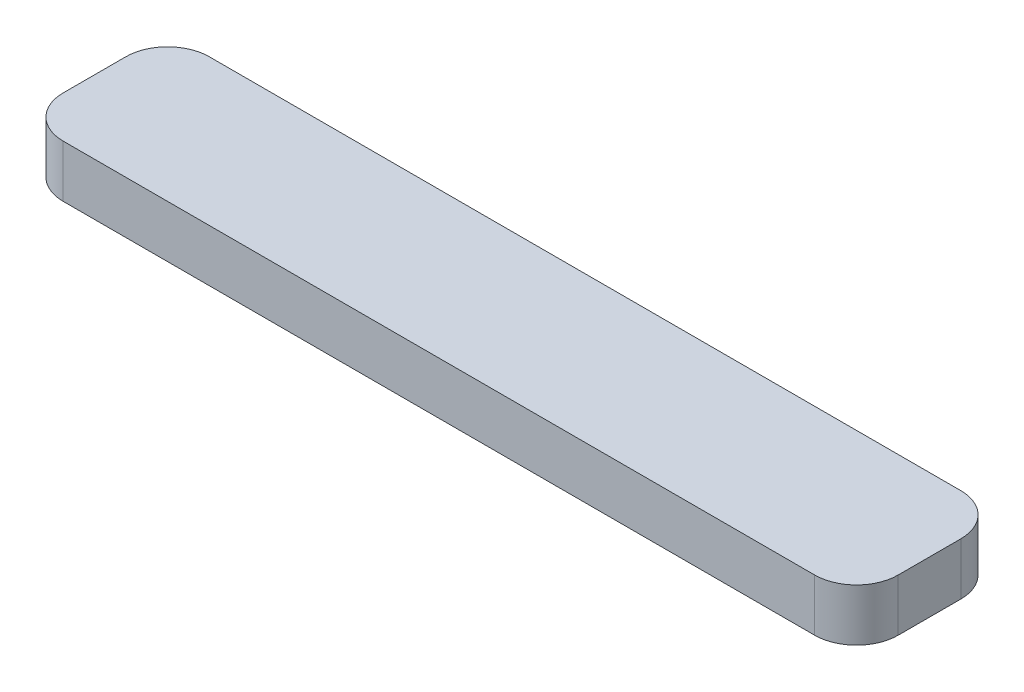
ISO-10303-21;
HEADER;
FILE_DESCRIPTION(('STEP AP214'),'2;1');
FILE_NAME('part.step','',(''),(''),'','','');
FILE_SCHEMA(('AUTOMOTIVE_DESIGN { 1 0 10303 214 1 1 1 1 }'));
ENDSEC;
DATA;
#1=APPLICATION_CONTEXT('core data for automotive mechanical design processes');
#2=APPLICATION_PROTOCOL_DEFINITION('international standard','automotive_design',2000,#1);
#3=PRODUCT_CONTEXT('',#1,'mechanical');
#4=PRODUCT('Part','Part','',(#3));
#5=PRODUCT_RELATED_PRODUCT_CATEGORY('part','',(#4));
#6=PRODUCT_DEFINITION_FORMATION('','',#4);
#7=PRODUCT_DEFINITION_CONTEXT('part definition',#1,'design');
#8=PRODUCT_DEFINITION('design','',#6,#7);
#9=PRODUCT_DEFINITION_SHAPE('','',#8);
#10=(LENGTH_UNIT() NAMED_UNIT(*) SI_UNIT(.MILLI.,.METRE.));
#11=(NAMED_UNIT(*) PLANE_ANGLE_UNIT() SI_UNIT($,.RADIAN.));
#12=(NAMED_UNIT(*) SI_UNIT($,.STERADIAN.) SOLID_ANGLE_UNIT());
#13=UNCERTAINTY_MEASURE_WITH_UNIT(LENGTH_MEASURE(1.E-05),#10,'distance_accuracy_value','');
#14=(GEOMETRIC_REPRESENTATION_CONTEXT(3) GLOBAL_UNCERTAINTY_ASSIGNED_CONTEXT((#13)) GLOBAL_UNIT_ASSIGNED_CONTEXT((#10,
#11,#12)) REPRESENTATION_CONTEXT('',''));
#15=CARTESIAN_POINT('',(0.,0.,0.));
#16=DIRECTION('',(0.,0.,1.));
#17=DIRECTION('',(1.,0.,0.));
#18=AXIS2_PLACEMENT_3D('',#15,#16,#17);
#19=CARTESIAN_POINT('',(-25.4,1.5875,-4.445));
#20=DIRECTION('',(1.,0.,0.));
#21=DIRECTION('',(0.,0.,-1.));
#22=AXIS2_PLACEMENT_3D('',#19,#20,#21);
#23=PLANE('',#22);
#24=DIRECTION('',(0.,0.,1.));
#25=VECTOR('',#24,1.);
#26=CARTESIAN_POINT('',(-25.4,1.5875,-4.445));
#27=LINE('',#26,#25);
#28=CARTESIAN_POINT('',(-25.4,1.5875,-1.905));
#29=VERTEX_POINT('',#28);
#30=CARTESIAN_POINT('',(-25.4,1.5875,1.905));
#31=VERTEX_POINT('',#30);
#32=EDGE_CURVE('E118',#29,#31,#27,.T.);
#33=ORIENTED_EDGE('',*,*,#32,.F.);
#34=DIRECTION('',(0.,-1.,0.));
#35=VECTOR('',#34,1.);
#36=CARTESIAN_POINT('',(-25.4,1.5875,-1.905));
#37=LINE('',#36,#35);
#38=CARTESIAN_POINT('',(-25.4,-1.5875,-1.905));
#39=VERTEX_POINT('',#38);
#40=EDGE_CURVE('E103',#29,#39,#37,.T.);
#41=ORIENTED_EDGE('',*,*,#40,.T.);
#42=DIRECTION('',(0.,0.,1.));
#43=VECTOR('',#42,1.);
#44=CARTESIAN_POINT('',(-25.4,-1.5875,-4.445));
#45=LINE('',#44,#43);
#46=CARTESIAN_POINT('',(-25.4,-1.5875,1.905));
#47=VERTEX_POINT('',#46);
#48=EDGE_CURVE('E115',#39,#47,#45,.T.);
#49=ORIENTED_EDGE('',*,*,#48,.T.);
#50=DIRECTION('',(0.,-1.,0.));
#51=VECTOR('',#50,1.);
#52=CARTESIAN_POINT('',(-25.4,1.5875,1.905));
#53=LINE('',#52,#51);
#54=EDGE_CURVE('E120',#47,#31,#53,.F.);
#55=ORIENTED_EDGE('',*,*,#54,.T.);
#56=EDGE_LOOP('',(#33,#41,#49,#55));
#57=FACE_BOUND('',#56,.T.);
#58=ADVANCED_FACE('F33',(#57),#23,.F.);
#59=CARTESIAN_POINT('',(25.4,1.5875,4.445));
#60=DIRECTION('',(0.,0.,-1.));
#61=DIRECTION('',(-1.,0.,0.));
#62=AXIS2_PLACEMENT_3D('',#59,#60,#61);
#63=PLANE('',#62);
#64=DIRECTION('',(1.,0.,0.));
#65=VECTOR('',#64,1.);
#66=CARTESIAN_POINT('',(25.4,1.5875,4.445));
#67=LINE('',#66,#65);
#68=CARTESIAN_POINT('',(-22.86,1.5875,4.445));
#69=VERTEX_POINT('',#68);
#70=CARTESIAN_POINT('',(22.86,1.5875,4.445));
#71=VERTEX_POINT('',#70);
#72=EDGE_CURVE('E160',#69,#71,#67,.T.);
#73=ORIENTED_EDGE('',*,*,#72,.F.);
#74=DIRECTION('',(0.,-1.,0.));
#75=VECTOR('',#74,1.);
#76=CARTESIAN_POINT('',(-22.86,1.5875,4.445));
#77=LINE('',#76,#75);
#78=CARTESIAN_POINT('',(-22.86,-1.5875,4.445));
#79=VERTEX_POINT('',#78);
#80=EDGE_CURVE('E153',#69,#79,#77,.T.);
#81=ORIENTED_EDGE('',*,*,#80,.T.);
#82=DIRECTION('',(1.,0.,0.));
#83=VECTOR('',#82,1.);
#84=CARTESIAN_POINT('',(25.4,-1.5875,4.445));
#85=LINE('',#84,#83);
#86=CARTESIAN_POINT('',(22.86,-1.5875,4.445));
#87=VERTEX_POINT('',#86);
#88=EDGE_CURVE('E124',#79,#87,#85,.T.);
#89=ORIENTED_EDGE('',*,*,#88,.T.);
#90=DIRECTION('',(0.,-1.,0.));
#91=VECTOR('',#90,1.);
#92=CARTESIAN_POINT('',(22.86,1.5875,4.445));
#93=LINE('',#92,#91);
#94=EDGE_CURVE('E151',#87,#71,#93,.F.);
#95=ORIENTED_EDGE('',*,*,#94,.T.);
#96=EDGE_LOOP('',(#73,#81,#89,#95));
#97=FACE_BOUND('',#96,.T.);
#98=ADVANCED_FACE('F158',(#97),#63,.F.);
#99=CARTESIAN_POINT('',(25.4,1.5875,-4.445));
#100=DIRECTION('',(-1.,0.,0.));
#101=DIRECTION('',(0.,0.,1.));
#102=AXIS2_PLACEMENT_3D('',#99,#100,#101);
#103=PLANE('',#102);
#104=DIRECTION('',(0.,0.,-1.));
#105=VECTOR('',#104,1.);
#106=CARTESIAN_POINT('',(25.4,1.5875,-4.445));
#107=LINE('',#106,#105);
#108=CARTESIAN_POINT('',(25.4,1.5875,1.905));
#109=VERTEX_POINT('',#108);
#110=CARTESIAN_POINT('',(25.4,1.5875,-1.905));
#111=VERTEX_POINT('',#110);
#112=EDGE_CURVE('E168',#109,#111,#107,.T.);
#113=ORIENTED_EDGE('',*,*,#112,.F.);
#114=DIRECTION('',(0.,-1.,0.));
#115=VECTOR('',#114,1.);
#116=CARTESIAN_POINT('',(25.4,1.5875,1.905));
#117=LINE('',#116,#115);
#118=CARTESIAN_POINT('',(25.4,-1.5875,1.905));
#119=VERTEX_POINT('',#118);
#120=EDGE_CURVE('E11',#109,#119,#117,.T.);
#121=ORIENTED_EDGE('',*,*,#120,.T.);
#122=DIRECTION('',(0.,0.,-1.));
#123=VECTOR('',#122,1.);
#124=CARTESIAN_POINT('',(25.4,-1.5875,-4.445));
#125=LINE('',#124,#123);
#126=CARTESIAN_POINT('',(25.4,-1.5875,-1.905));
#127=VERTEX_POINT('',#126);
#128=EDGE_CURVE('E127',#119,#127,#125,.T.);
#129=ORIENTED_EDGE('',*,*,#128,.T.);
#130=DIRECTION('',(0.,-1.,0.));
#131=VECTOR('',#130,1.);
#132=CARTESIAN_POINT('',(25.4,1.5875,-1.905));
#133=LINE('',#132,#131);
#134=EDGE_CURVE('E41',#127,#111,#133,.F.);
#135=ORIENTED_EDGE('',*,*,#134,.T.);
#136=EDGE_LOOP('',(#113,#121,#129,#135));
#137=FACE_BOUND('',#136,.T.);
#138=ADVANCED_FACE('F167',(#137),#103,.F.);
#139=CARTESIAN_POINT('',(25.4,1.5875,-4.445));
#140=DIRECTION('',(0.,0.,1.));
#141=DIRECTION('',(1.,0.,0.));
#142=AXIS2_PLACEMENT_3D('',#139,#140,#141);
#143=PLANE('',#142);
#144=DIRECTION('',(-1.,0.,0.));
#145=VECTOR('',#144,1.);
#146=CARTESIAN_POINT('',(25.4,-1.5875,-4.445));
#147=LINE('',#146,#145);
#148=CARTESIAN_POINT('',(22.86,-1.5875,-4.445));
#149=VERTEX_POINT('',#148);
#150=CARTESIAN_POINT('',(-22.86,-1.5875,-4.445));
#151=VERTEX_POINT('',#150);
#152=EDGE_CURVE('E134',#149,#151,#147,.T.);
#153=ORIENTED_EDGE('',*,*,#152,.T.);
#154=DIRECTION('',(0.,-1.,0.));
#155=VECTOR('',#154,1.);
#156=CARTESIAN_POINT('',(-22.86,1.5875,-4.445));
#157=LINE('',#156,#155);
#158=CARTESIAN_POINT('',(-22.86,1.5875,-4.445));
#159=VERTEX_POINT('',#158);
#160=EDGE_CURVE('E104',#151,#159,#157,.F.);
#161=ORIENTED_EDGE('',*,*,#160,.T.);
#162=DIRECTION('',(-1.,0.,0.));
#163=VECTOR('',#162,1.);
#164=CARTESIAN_POINT('',(25.4,1.5875,-4.445));
#165=LINE('',#164,#163);
#166=CARTESIAN_POINT('',(22.86,1.5875,-4.445));
#167=VERTEX_POINT('',#166);
#168=EDGE_CURVE('E130',#167,#159,#165,.T.);
#169=ORIENTED_EDGE('',*,*,#168,.F.);
#170=DIRECTION('',(0.,-1.,0.));
#171=VECTOR('',#170,1.);
#172=CARTESIAN_POINT('',(22.86,1.5875,-4.445));
#173=LINE('',#172,#171);
#174=EDGE_CURVE('E109',#167,#149,#173,.T.);
#175=ORIENTED_EDGE('',*,*,#174,.T.);
#176=EDGE_LOOP('',(#153,#161,#169,#175));
#177=FACE_BOUND('',#176,.T.);
#178=ADVANCED_FACE('F191',(#177),#143,.F.);
#179=CARTESIAN_POINT('',(0.,1.5875,0.));
#180=DIRECTION('',(0.,-1.,0.));
#181=DIRECTION('',(0.,0.,-1.));
#182=AXIS2_PLACEMENT_3D('',#179,#180,#181);
#183=PLANE('',#182);
#184=ORIENTED_EDGE('',*,*,#168,.T.);
#185=CARTESIAN_POINT('',(-22.86,1.5875,-1.905));
#186=DIRECTION('',(0.,-1.,0.));
#187=DIRECTION('',(0.,0.,-1.));
#188=AXIS2_PLACEMENT_3D('',#185,#186,#187);
#189=CIRCLE('',#188,2.54);
#190=EDGE_CURVE('E149',#159,#29,#189,.F.);
#191=ORIENTED_EDGE('',*,*,#190,.T.);
#192=ORIENTED_EDGE('',*,*,#32,.T.);
#193=CARTESIAN_POINT('',(-22.86,1.5875,1.905));
#194=DIRECTION('',(0.,-1.,0.));
#195=DIRECTION('',(0.,0.,-1.));
#196=AXIS2_PLACEMENT_3D('',#193,#194,#195);
#197=CIRCLE('',#196,2.54);
#198=EDGE_CURVE('E147',#31,#69,#197,.F.);
#199=ORIENTED_EDGE('',*,*,#198,.T.);
#200=ORIENTED_EDGE('',*,*,#72,.T.);
#201=CARTESIAN_POINT('',(22.86,1.5875,1.905));
#202=DIRECTION('',(0.,-1.,0.));
#203=DIRECTION('',(0.,0.,-1.));
#204=AXIS2_PLACEMENT_3D('',#201,#202,#203);
#205=CIRCLE('',#204,2.54);
#206=EDGE_CURVE('E54',#71,#109,#205,.F.);
#207=ORIENTED_EDGE('',*,*,#206,.T.);
#208=ORIENTED_EDGE('',*,*,#112,.T.);
#209=CARTESIAN_POINT('',(22.86,1.5875,-1.905));
#210=DIRECTION('',(0.,-1.,0.));
#211=DIRECTION('',(0.,0.,-1.));
#212=AXIS2_PLACEMENT_3D('',#209,#210,#211);
#213=CIRCLE('',#212,2.54);
#214=EDGE_CURVE('E144',#111,#167,#213,.F.);
#215=ORIENTED_EDGE('',*,*,#214,.T.);
#216=EDGE_LOOP('',(#184,#191,#192,#199,#200,#207,#208,#215));
#217=FACE_BOUND('',#216,.T.);
#218=ADVANCED_FACE('F173',(#217),#183,.F.);
#219=CARTESIAN_POINT('',(0.,-1.5875,0.));
#220=DIRECTION('',(0.,-1.,0.));
#221=DIRECTION('',(0.,0.,-1.));
#222=AXIS2_PLACEMENT_3D('',#219,#220,#221);
#223=PLANE('',#222);
#224=ORIENTED_EDGE('',*,*,#48,.F.);
#225=CARTESIAN_POINT('',(-22.86,-1.5875,-1.905));
#226=DIRECTION('',(0.,-1.,0.));
#227=DIRECTION('',(0.,0.,-1.));
#228=AXIS2_PLACEMENT_3D('',#225,#226,#227);
#229=CIRCLE('',#228,2.54);
#230=EDGE_CURVE('E99',#39,#151,#229,.T.);
#231=ORIENTED_EDGE('',*,*,#230,.T.);
#232=ORIENTED_EDGE('',*,*,#152,.F.);
#233=CARTESIAN_POINT('',(22.86,-1.5875,-1.905));
#234=DIRECTION('',(0.,-1.,0.));
#235=DIRECTION('',(0.,0.,-1.));
#236=AXIS2_PLACEMENT_3D('',#233,#234,#235);
#237=CIRCLE('',#236,2.54);
#238=EDGE_CURVE('E119',#149,#127,#237,.T.);
#239=ORIENTED_EDGE('',*,*,#238,.T.);
#240=ORIENTED_EDGE('',*,*,#128,.F.);
#241=CARTESIAN_POINT('',(22.86,-1.5875,1.905));
#242=DIRECTION('',(0.,-1.,0.));
#243=DIRECTION('',(0.,0.,-1.));
#244=AXIS2_PLACEMENT_3D('',#241,#242,#243);
#245=CIRCLE('',#244,2.54);
#246=EDGE_CURVE('E138',#119,#87,#245,.T.);
#247=ORIENTED_EDGE('',*,*,#246,.T.);
#248=ORIENTED_EDGE('',*,*,#88,.F.);
#249=CARTESIAN_POINT('',(-22.86,-1.5875,1.905));
#250=DIRECTION('',(0.,-1.,0.));
#251=DIRECTION('',(0.,0.,-1.));
#252=AXIS2_PLACEMENT_3D('',#249,#250,#251);
#253=CIRCLE('',#252,2.54);
#254=EDGE_CURVE('E110',#79,#47,#253,.T.);
#255=ORIENTED_EDGE('',*,*,#254,.T.);
#256=EDGE_LOOP('',(#224,#231,#232,#239,#240,#247,#248,#255));
#257=FACE_BOUND('',#256,.T.);
#258=ADVANCED_FACE('F122',(#257),#223,.T.);
#259=CARTESIAN_POINT('',(-22.86,1.5875,-1.905));
#260=DIRECTION('',(0.,-1.,0.));
#261=DIRECTION('',(0.,0.,-1.));
#262=AXIS2_PLACEMENT_3D('',#259,#260,#261);
#263=CYLINDRICAL_SURFACE('',#262,2.54);
#264=ORIENTED_EDGE('',*,*,#190,.F.);
#265=ORIENTED_EDGE('',*,*,#160,.F.);
#266=ORIENTED_EDGE('',*,*,#230,.F.);
#267=ORIENTED_EDGE('',*,*,#40,.F.);
#268=EDGE_LOOP('',(#264,#265,#266,#267));
#269=FACE_BOUND('',#268,.T.);
#270=ADVANCED_FACE('F102',(#269),#263,.T.);
#271=CARTESIAN_POINT('',(-22.86,1.5875,1.905));
#272=DIRECTION('',(0.,-1.,0.));
#273=DIRECTION('',(0.,0.,-1.));
#274=AXIS2_PLACEMENT_3D('',#271,#272,#273);
#275=CYLINDRICAL_SURFACE('',#274,2.54);
#276=ORIENTED_EDGE('',*,*,#198,.F.);
#277=ORIENTED_EDGE('',*,*,#54,.F.);
#278=ORIENTED_EDGE('',*,*,#254,.F.);
#279=ORIENTED_EDGE('',*,*,#80,.F.);
#280=EDGE_LOOP('',(#276,#277,#278,#279));
#281=FACE_BOUND('',#280,.T.);
#282=ADVANCED_FACE('F174',(#281),#275,.T.);
#283=CARTESIAN_POINT('',(22.86,1.5875,1.905));
#284=DIRECTION('',(0.,-1.,0.));
#285=DIRECTION('',(0.,0.,-1.));
#286=AXIS2_PLACEMENT_3D('',#283,#284,#285);
#287=CYLINDRICAL_SURFACE('',#286,2.54);
#288=ORIENTED_EDGE('',*,*,#206,.F.);
#289=ORIENTED_EDGE('',*,*,#94,.F.);
#290=ORIENTED_EDGE('',*,*,#246,.F.);
#291=ORIENTED_EDGE('',*,*,#120,.F.);
#292=EDGE_LOOP('',(#288,#289,#290,#291));
#293=FACE_BOUND('',#292,.T.);
#294=ADVANCED_FACE('F166',(#293),#287,.T.);
#295=CARTESIAN_POINT('',(22.86,1.5875,-1.905));
#296=DIRECTION('',(0.,-1.,0.));
#297=DIRECTION('',(0.,0.,-1.));
#298=AXIS2_PLACEMENT_3D('',#295,#296,#297);
#299=CYLINDRICAL_SURFACE('',#298,2.54);
#300=ORIENTED_EDGE('',*,*,#214,.F.);
#301=ORIENTED_EDGE('',*,*,#134,.F.);
#302=ORIENTED_EDGE('',*,*,#238,.F.);
#303=ORIENTED_EDGE('',*,*,#174,.F.);
#304=EDGE_LOOP('',(#300,#301,#302,#303));
#305=FACE_BOUND('',#304,.T.);
#306=ADVANCED_FACE('F35',(#305),#299,.T.);
#307=CLOSED_SHELL('',(#58,#98,#138,#178,#218,#258,#270,#282,#294,#306));
#308=MANIFOLD_SOLID_BREP('B2',#307);
#309=ADVANCED_BREP_SHAPE_REPRESENTATION('',(#18,#308),#14);
#310=SHAPE_DEFINITION_REPRESENTATION(#9,#309);
ENDSEC;
END-ISO-10303-21;
